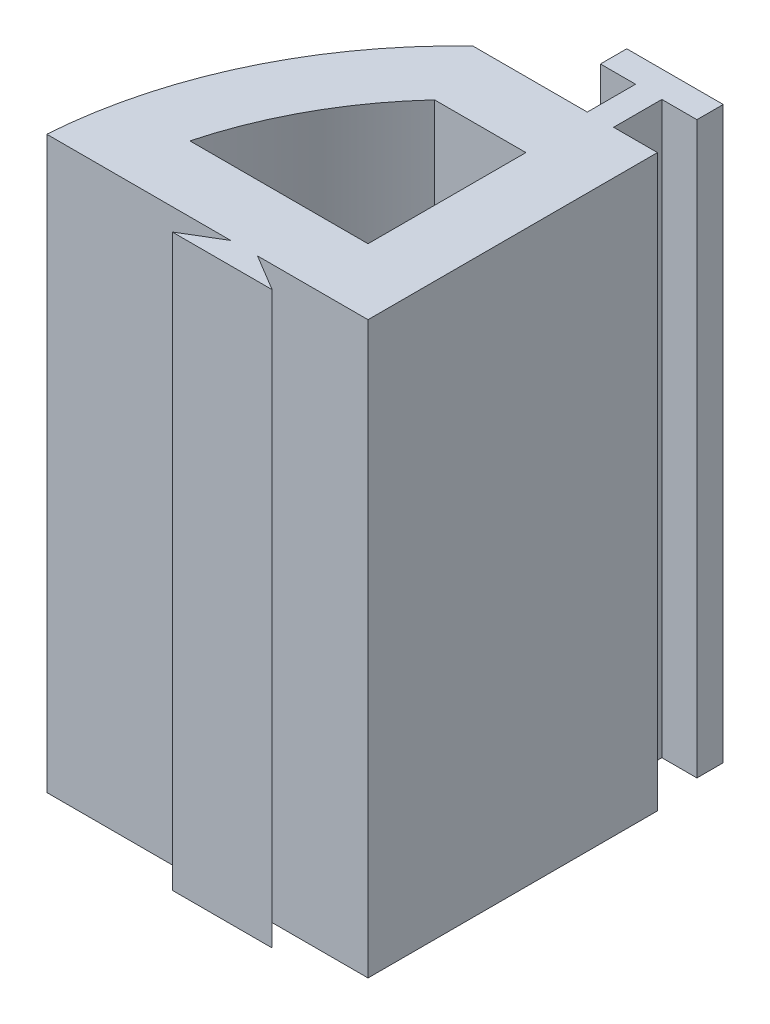
ISO-10303-21;
HEADER;
FILE_DESCRIPTION(('STEP AP214'),'2;1');
FILE_NAME('part.step','',(''),(''),'','','');
FILE_SCHEMA(('AUTOMOTIVE_DESIGN { 1 0 10303 214 1 1 1 1 }'));
ENDSEC;
DATA;
#1=APPLICATION_CONTEXT('core data for automotive mechanical design processes');
#2=APPLICATION_PROTOCOL_DEFINITION('international standard','automotive_design',2000,#1);
#3=PRODUCT_CONTEXT('',#1,'mechanical');
#4=PRODUCT('Part','Part','',(#3));
#5=PRODUCT_RELATED_PRODUCT_CATEGORY('part','',(#4));
#6=PRODUCT_DEFINITION_FORMATION('','',#4);
#7=PRODUCT_DEFINITION_CONTEXT('part definition',#1,'design');
#8=PRODUCT_DEFINITION('design','',#6,#7);
#9=PRODUCT_DEFINITION_SHAPE('','',#8);
#10=(LENGTH_UNIT() NAMED_UNIT(*) SI_UNIT(.MILLI.,.METRE.));
#11=(NAMED_UNIT(*) PLANE_ANGLE_UNIT() SI_UNIT($,.RADIAN.));
#12=(NAMED_UNIT(*) SI_UNIT($,.STERADIAN.) SOLID_ANGLE_UNIT());
#13=UNCERTAINTY_MEASURE_WITH_UNIT(LENGTH_MEASURE(1.E-05),#10,'distance_accuracy_value','');
#14=(GEOMETRIC_REPRESENTATION_CONTEXT(3) GLOBAL_UNCERTAINTY_ASSIGNED_CONTEXT((#13)) GLOBAL_UNIT_ASSIGNED_CONTEXT((#10,
#11,#12)) REPRESENTATION_CONTEXT('',''));
#15=CARTESIAN_POINT('',(0.,0.,0.));
#16=DIRECTION('',(0.,0.,1.));
#17=DIRECTION('',(1.,0.,0.));
#18=AXIS2_PLACEMENT_3D('',#15,#16,#17);
#19=CARTESIAN_POINT('',(0.,13.,-7.3));
#20=DIRECTION('',(0.,0.,-1.));
#21=DIRECTION('',(-1.,0.,0.));
#22=AXIS2_PLACEMENT_3D('',#19,#20,#21);
#23=PLANE('',#22);
#24=DIRECTION('',(1.,0.,0.));
#25=VECTOR('',#24,1.);
#26=CARTESIAN_POINT('',(0.,0.,-7.3));
#27=LINE('',#26,#25);
#28=CARTESIAN_POINT('',(-6.90742354282695,0.,-7.3));
#29=VERTEX_POINT('',#28);
#30=CARTESIAN_POINT('',(-4.3,0.,-7.3));
#31=VERTEX_POINT('',#30);
#32=EDGE_CURVE('E203',#29,#31,#27,.T.);
#33=ORIENTED_EDGE('',*,*,#32,.F.);
#34=DIRECTION('',(0.,-1.,0.));
#35=VECTOR('',#34,1.);
#36=CARTESIAN_POINT('',(-6.90742354282695,13.,-7.3));
#37=LINE('',#36,#35);
#38=CARTESIAN_POINT('',(-6.90742354282695,13.,-7.3));
#39=VERTEX_POINT('',#38);
#40=EDGE_CURVE('E11',#39,#29,#37,.T.);
#41=ORIENTED_EDGE('',*,*,#40,.F.);
#42=DIRECTION('',(1.,0.,0.));
#43=VECTOR('',#42,1.);
#44=CARTESIAN_POINT('',(0.,13.,-7.3));
#45=LINE('',#44,#43);
#46=CARTESIAN_POINT('',(-4.3,13.,-7.3));
#47=VERTEX_POINT('',#46);
#48=EDGE_CURVE('E207',#39,#47,#45,.T.);
#49=ORIENTED_EDGE('',*,*,#48,.T.);
#50=DIRECTION('',(0.,-1.,0.));
#51=VECTOR('',#50,1.);
#52=CARTESIAN_POINT('',(-4.3,13.,-7.3));
#53=LINE('',#52,#51);
#54=EDGE_CURVE('E249',#47,#31,#53,.T.);
#55=ORIENTED_EDGE('',*,*,#54,.T.);
#56=EDGE_LOOP('',(#33,#41,#49,#55));
#57=FACE_BOUND('',#56,.T.);
#58=ADVANCED_FACE('F34',(#57),#23,.T.);
#59=CARTESIAN_POINT('',(0.,13.,0.));
#60=DIRECTION('',(0.,-1.,0.));
#61=DIRECTION('',(0.,0.,-1.));
#62=AXIS2_PLACEMENT_3D('',#59,#60,#61);
#63=CYLINDRICAL_SURFACE('',#62,10.05);
#64=CARTESIAN_POINT('',(0.,0.,0.));
#65=DIRECTION('',(0.,1.,0.));
#66=DIRECTION('',(0.,0.,1.));
#67=AXIS2_PLACEMENT_3D('',#64,#65,#66);
#68=CIRCLE('',#67,10.05);
#69=CARTESIAN_POINT('',(-10.0255922518321,0.,-0.700000000002893));
#70=VERTEX_POINT('',#69);
#71=EDGE_CURVE('E252',#29,#70,#68,.T.);
#72=ORIENTED_EDGE('',*,*,#71,.T.);
#73=DIRECTION('',(0.,-1.,0.));
#74=VECTOR('',#73,1.);
#75=CARTESIAN_POINT('',(-10.0255922518321,13.,-0.700000000002893));
#76=LINE('',#75,#74);
#77=CARTESIAN_POINT('',(-10.0255922518321,13.,-0.700000000002893));
#78=VERTEX_POINT('',#77);
#79=EDGE_CURVE('E42',#78,#70,#76,.T.);
#80=ORIENTED_EDGE('',*,*,#79,.F.);
#81=CARTESIAN_POINT('',(0.,13.,0.));
#82=DIRECTION('',(0.,1.,0.));
#83=DIRECTION('',(0.,0.,1.));
#84=AXIS2_PLACEMENT_3D('',#81,#82,#83);
#85=CIRCLE('',#84,10.05);
#86=EDGE_CURVE('E210',#39,#78,#85,.T.);
#87=ORIENTED_EDGE('',*,*,#86,.F.);
#88=ORIENTED_EDGE('',*,*,#40,.T.);
#89=EDGE_LOOP('',(#72,#80,#87,#88));
#90=FACE_BOUND('',#89,.T.);
#91=ADVANCED_FACE('F36',(#90),#63,.T.);
#92=CARTESIAN_POINT('',(5.06438720404951E-13,13.,-0.69999999999564));
#93=DIRECTION('',(-7.23483886297294E-13,0.,1.));
#94=DIRECTION('',(1.,0.,7.23483886297294E-13));
#95=AXIS2_PLACEMENT_3D('',#92,#93,#94);
#96=PLANE('',#95);
#97=DIRECTION('',(-1.,0.,-7.23483886297294E-13));
#98=VECTOR('',#97,1.);
#99=CARTESIAN_POINT('',(5.06438720404951E-13,0.,-0.69999999999564));
#100=LINE('',#99,#98);
#101=CARTESIAN_POINT('',(-5.83063493683872,0.,-0.699999999999858));
#102=VERTEX_POINT('',#101);
#103=EDGE_CURVE('E256',#102,#70,#100,.T.);
#104=ORIENTED_EDGE('',*,*,#103,.F.);
#105=DIRECTION('',(0.,-1.,0.));
#106=VECTOR('',#105,1.);
#107=CARTESIAN_POINT('',(-5.83063493683872,13.,-0.699999999999858));
#108=LINE('',#107,#106);
#109=CARTESIAN_POINT('',(-5.83063493683872,13.,-0.699999999999858));
#110=VERTEX_POINT('',#109);
#111=EDGE_CURVE('E317',#110,#102,#108,.T.);
#112=ORIENTED_EDGE('',*,*,#111,.F.);
#113=DIRECTION('',(-1.,0.,-7.23483886297294E-13));
#114=VECTOR('',#113,1.);
#115=CARTESIAN_POINT('',(5.06438720404951E-13,13.,-0.69999999999564));
#116=LINE('',#115,#114);
#117=EDGE_CURVE('E214',#110,#78,#116,.T.);
#118=ORIENTED_EDGE('',*,*,#117,.T.);
#119=ORIENTED_EDGE('',*,*,#79,.T.);
#120=EDGE_LOOP('',(#104,#112,#118,#119));
#121=FACE_BOUND('',#120,.T.);
#122=ADVANCED_FACE('F321',(#121),#96,.T.);
#123=CARTESIAN_POINT('',(-1.85222689504543,13.,-3.08704482507578));
#124=DIRECTION('',(-0.514495755427519,0.,-0.857492925712549));
#125=DIRECTION('',(-0.857492925712549,0.,0.514495755427519));
#126=AXIS2_PLACEMENT_3D('',#123,#124,#125);
#127=PLANE('',#126);
#128=DIRECTION('',(0.857492925712549,0.,-0.514495755427519));
#129=VECTOR('',#128,1.);
#130=CARTESIAN_POINT('',(-1.85222689504543,0.,-3.08704482507578));
#131=LINE('',#130,#129);
#132=CARTESIAN_POINT('',(-6.66396827017183,0.,-0.199999999999999));
#133=VERTEX_POINT('',#132);
#134=EDGE_CURVE('E259',#133,#102,#131,.T.);
#135=ORIENTED_EDGE('',*,*,#134,.F.);
#136=DIRECTION('',(0.,-1.,0.));
#137=VECTOR('',#136,1.);
#138=CARTESIAN_POINT('',(-6.66396827017183,13.,-0.199999999999999));
#139=LINE('',#138,#137);
#140=CARTESIAN_POINT('',(-6.66396827017183,13.,-0.199999999999999));
#141=VERTEX_POINT('',#140);
#142=EDGE_CURVE('E315',#141,#133,#139,.T.);
#143=ORIENTED_EDGE('',*,*,#142,.F.);
#144=DIRECTION('',(0.857492925712549,0.,-0.514495755427519));
#145=VECTOR('',#144,1.);
#146=CARTESIAN_POINT('',(-1.85222689504543,13.,-3.08704482507578));
#147=LINE('',#146,#145);
#148=EDGE_CURVE('E217',#141,#110,#147,.T.);
#149=ORIENTED_EDGE('',*,*,#148,.T.);
#150=ORIENTED_EDGE('',*,*,#111,.T.);
#151=EDGE_LOOP('',(#135,#143,#149,#150));
#152=FACE_BOUND('',#151,.T.);
#153=ADVANCED_FACE('F331',(#152),#127,.T.);
#154=CARTESIAN_POINT('',(0.,13.,-0.2));
#155=DIRECTION('',(0.,0.,1.));
#156=DIRECTION('',(1.,0.,0.));
#157=AXIS2_PLACEMENT_3D('',#154,#155,#156);
#158=PLANE('',#157);
#159=DIRECTION('',(-1.,0.,0.));
#160=VECTOR('',#159,1.);
#161=CARTESIAN_POINT('',(0.,0.,-0.2));
#162=LINE('',#161,#160);
#163=CARTESIAN_POINT('',(-4.38603172982818,0.,-0.2));
#164=VERTEX_POINT('',#163);
#165=EDGE_CURVE('E263',#164,#133,#162,.T.);
#166=ORIENTED_EDGE('',*,*,#165,.F.);
#167=DIRECTION('',(0.,-1.,0.));
#168=VECTOR('',#167,1.);
#169=CARTESIAN_POINT('',(-4.38603172982818,13.,-0.2));
#170=LINE('',#169,#168);
#171=CARTESIAN_POINT('',(-4.38603172982818,13.,-0.2));
#172=VERTEX_POINT('',#171);
#173=EDGE_CURVE('E313',#172,#164,#170,.T.);
#174=ORIENTED_EDGE('',*,*,#173,.F.);
#175=DIRECTION('',(-1.,0.,0.));
#176=VECTOR('',#175,1.);
#177=CARTESIAN_POINT('',(0.,13.,-0.2));
#178=LINE('',#177,#176);
#179=EDGE_CURVE('E221',#172,#141,#178,.T.);
#180=ORIENTED_EDGE('',*,*,#179,.T.);
#181=ORIENTED_EDGE('',*,*,#142,.T.);
#182=EDGE_LOOP('',(#166,#174,#180,#181));
#183=FACE_BOUND('',#182,.T.);
#184=ADVANCED_FACE('F387',(#183),#158,.T.);
#185=CARTESIAN_POINT('',(-1.07277310495452,13.,1.7879551749242));
#186=DIRECTION('',(-0.514495755427527,0.,0.857492925712544));
#187=DIRECTION('',(0.857492925712544,0.,0.514495755427527));
#188=AXIS2_PLACEMENT_3D('',#185,#186,#187);
#189=PLANE('',#188);
#190=DIRECTION('',(-0.857492925712544,0.,-0.514495755427527));
#191=VECTOR('',#190,1.);
#192=CARTESIAN_POINT('',(-1.07277310495452,0.,1.7879551749242));
#193=LINE('',#192,#191);
#194=CARTESIAN_POINT('',(-5.21936506316047,0.,-0.699999999999416));
#195=VERTEX_POINT('',#194);
#196=EDGE_CURVE('E266',#164,#195,#193,.T.);
#197=ORIENTED_EDGE('',*,*,#196,.T.);
#198=DIRECTION('',(0.,-1.,0.));
#199=VECTOR('',#198,1.);
#200=CARTESIAN_POINT('',(-5.21936506316047,13.,-0.699999999999416));
#201=LINE('',#200,#199);
#202=CARTESIAN_POINT('',(-5.21936506316047,13.,-0.699999999999416));
#203=VERTEX_POINT('',#202);
#204=EDGE_CURVE('E311',#203,#195,#201,.T.);
#205=ORIENTED_EDGE('',*,*,#204,.F.);
#206=DIRECTION('',(-0.857492925712544,0.,-0.514495755427527));
#207=VECTOR('',#206,1.);
#208=CARTESIAN_POINT('',(-1.07277310495452,13.,1.7879551749242));
#209=LINE('',#208,#207);
#210=EDGE_CURVE('E224',#172,#203,#209,.T.);
#211=ORIENTED_EDGE('',*,*,#210,.F.);
#212=ORIENTED_EDGE('',*,*,#173,.T.);
#213=EDGE_LOOP('',(#197,#205,#211,#212));
#214=FACE_BOUND('',#213,.T.);
#215=ADVANCED_FACE('F385',(#214),#189,.F.);
#216=CARTESIAN_POINT('',(-2.70000000000038,0.,-0.699999999997593));
#217=VERTEX_POINT('',#216);
#218=EDGE_CURVE('E260',#217,#195,#100,.T.);
#219=ORIENTED_EDGE('',*,*,#218,.F.);
#220=DIRECTION('',(0.,-1.,0.));
#221=VECTOR('',#220,1.);
#222=CARTESIAN_POINT('',(-2.70000000000038,13.,-0.699999999997593));
#223=LINE('',#222,#221);
#224=CARTESIAN_POINT('',(-2.70000000000038,13.,-0.699999999997593));
#225=VERTEX_POINT('',#224);
#226=EDGE_CURVE('E309',#225,#217,#223,.T.);
#227=ORIENTED_EDGE('',*,*,#226,.F.);
#228=EDGE_CURVE('E218',#225,#203,#116,.T.);
#229=ORIENTED_EDGE('',*,*,#228,.T.);
#230=ORIENTED_EDGE('',*,*,#204,.T.);
#231=EDGE_LOOP('',(#219,#227,#229,#230));
#232=FACE_BOUND('',#231,.T.);
#233=ADVANCED_FACE('F379',(#232),#96,.T.);
#234=CARTESIAN_POINT('',(-2.70000000000038,13.,0.));
#235=DIRECTION('',(1.,0.,0.));
#236=DIRECTION('',(0.,0.,-1.));
#237=AXIS2_PLACEMENT_3D('',#234,#235,#236);
#238=PLANE('',#237);
#239=DIRECTION('',(0.,0.,1.));
#240=VECTOR('',#239,1.);
#241=CARTESIAN_POINT('',(-2.70000000000038,0.,0.));
#242=LINE('',#241,#240);
#243=CARTESIAN_POINT('',(-2.70000000000038,0.,-7.3));
#244=VERTEX_POINT('',#243);
#245=EDGE_CURVE('E269',#244,#217,#242,.T.);
#246=ORIENTED_EDGE('',*,*,#245,.F.);
#247=DIRECTION('',(0.,-1.,0.));
#248=VECTOR('',#247,1.);
#249=CARTESIAN_POINT('',(-2.70000000000038,13.,-7.3));
#250=LINE('',#249,#248);
#251=CARTESIAN_POINT('',(-2.70000000000038,13.,-7.3));
#252=VERTEX_POINT('',#251);
#253=EDGE_CURVE('E307',#252,#244,#250,.T.);
#254=ORIENTED_EDGE('',*,*,#253,.F.);
#255=DIRECTION('',(0.,0.,1.));
#256=VECTOR('',#255,1.);
#257=CARTESIAN_POINT('',(-2.70000000000038,13.,0.));
#258=LINE('',#257,#256);
#259=EDGE_CURVE('E226',#252,#225,#258,.T.);
#260=ORIENTED_EDGE('',*,*,#259,.T.);
#261=ORIENTED_EDGE('',*,*,#226,.T.);
#262=EDGE_LOOP('',(#246,#254,#260,#261));
#263=FACE_BOUND('',#262,.T.);
#264=ADVANCED_FACE('F375',(#263),#238,.T.);
#265=CARTESIAN_POINT('',(-3.70000000000029,0.,-7.3));
#266=VERTEX_POINT('',#265);
#267=EDGE_CURVE('E253',#266,#244,#27,.T.);
#268=ORIENTED_EDGE('',*,*,#267,.F.);
#269=DIRECTION('',(0.,-1.,0.));
#270=VECTOR('',#269,1.);
#271=CARTESIAN_POINT('',(-3.70000000000029,13.,-7.3));
#272=LINE('',#271,#270);
#273=CARTESIAN_POINT('',(-3.70000000000029,13.,-7.3));
#274=VERTEX_POINT('',#273);
#275=EDGE_CURVE('E305',#274,#266,#272,.T.);
#276=ORIENTED_EDGE('',*,*,#275,.F.);
#277=EDGE_CURVE('E212',#274,#252,#45,.T.);
#278=ORIENTED_EDGE('',*,*,#277,.T.);
#279=ORIENTED_EDGE('',*,*,#253,.T.);
#280=EDGE_LOOP('',(#268,#276,#278,#279));
#281=FACE_BOUND('',#280,.T.);
#282=ADVANCED_FACE('F371',(#281),#23,.T.);
#283=CARTESIAN_POINT('',(-3.70000000000029,13.,0.));
#284=DIRECTION('',(1.,0.,0.));
#285=DIRECTION('',(0.,0.,-1.));
#286=AXIS2_PLACEMENT_3D('',#283,#284,#285);
#287=PLANE('',#286);
#288=DIRECTION('',(0.,0.,1.));
#289=VECTOR('',#288,1.);
#290=CARTESIAN_POINT('',(-3.70000000000029,0.,0.));
#291=LINE('',#290,#289);
#292=CARTESIAN_POINT('',(-3.70000000000029,0.,-8.4));
#293=VERTEX_POINT('',#292);
#294=EDGE_CURVE('E272',#293,#266,#291,.T.);
#295=ORIENTED_EDGE('',*,*,#294,.F.);
#296=DIRECTION('',(0.,-1.,0.));
#297=VECTOR('',#296,1.);
#298=CARTESIAN_POINT('',(-3.70000000000029,13.,-8.4));
#299=LINE('',#298,#297);
#300=CARTESIAN_POINT('',(-3.70000000000029,13.,-8.4));
#301=VERTEX_POINT('',#300);
#302=EDGE_CURVE('E303',#301,#293,#299,.T.);
#303=ORIENTED_EDGE('',*,*,#302,.F.);
#304=DIRECTION('',(0.,0.,1.));
#305=VECTOR('',#304,1.);
#306=CARTESIAN_POINT('',(-3.70000000000029,13.,0.));
#307=LINE('',#306,#305);
#308=EDGE_CURVE('E229',#301,#274,#307,.T.);
#309=ORIENTED_EDGE('',*,*,#308,.T.);
#310=ORIENTED_EDGE('',*,*,#275,.T.);
#311=EDGE_LOOP('',(#295,#303,#309,#310));
#312=FACE_BOUND('',#311,.T.);
#313=ADVANCED_FACE('F366',(#312),#287,.T.);
#314=CARTESIAN_POINT('',(0.,13.,-8.4));
#315=DIRECTION('',(0.,0.,1.));
#316=DIRECTION('',(1.,0.,0.));
#317=AXIS2_PLACEMENT_3D('',#314,#315,#316);
#318=PLANE('',#317);
#319=DIRECTION('',(-1.,0.,0.));
#320=VECTOR('',#319,1.);
#321=CARTESIAN_POINT('',(0.,0.,-8.4));
#322=LINE('',#321,#320);
#323=CARTESIAN_POINT('',(-2.90000000000029,0.,-8.4));
#324=VERTEX_POINT('',#323);
#325=EDGE_CURVE('E275',#324,#293,#322,.T.);
#326=ORIENTED_EDGE('',*,*,#325,.F.);
#327=DIRECTION('',(0.,-1.,0.));
#328=VECTOR('',#327,1.);
#329=CARTESIAN_POINT('',(-2.90000000000029,13.,-8.4));
#330=LINE('',#329,#328);
#331=CARTESIAN_POINT('',(-2.90000000000029,13.,-8.4));
#332=VERTEX_POINT('',#331);
#333=EDGE_CURVE('E301',#332,#324,#330,.T.);
#334=ORIENTED_EDGE('',*,*,#333,.F.);
#335=DIRECTION('',(-1.,0.,0.));
#336=VECTOR('',#335,1.);
#337=CARTESIAN_POINT('',(0.,13.,-8.4));
#338=LINE('',#337,#336);
#339=EDGE_CURVE('E232',#332,#301,#338,.T.);
#340=ORIENTED_EDGE('',*,*,#339,.T.);
#341=ORIENTED_EDGE('',*,*,#302,.T.);
#342=EDGE_LOOP('',(#326,#334,#340,#341));
#343=FACE_BOUND('',#342,.T.);
#344=ADVANCED_FACE('F361',(#343),#318,.T.);
#345=CARTESIAN_POINT('',(-2.90000000000029,13.,0.));
#346=DIRECTION('',(1.,0.,0.));
#347=DIRECTION('',(0.,0.,-1.));
#348=AXIS2_PLACEMENT_3D('',#345,#346,#347);
#349=PLANE('',#348);
#350=DIRECTION('',(0.,0.,1.));
#351=VECTOR('',#350,1.);
#352=CARTESIAN_POINT('',(-2.90000000000029,0.,0.));
#353=LINE('',#352,#351);
#354=CARTESIAN_POINT('',(-2.90000000000029,0.,-9.));
#355=VERTEX_POINT('',#354);
#356=EDGE_CURVE('E278',#355,#324,#353,.T.);
#357=ORIENTED_EDGE('',*,*,#356,.F.);
#358=DIRECTION('',(0.,-1.,0.));
#359=VECTOR('',#358,1.);
#360=CARTESIAN_POINT('',(-2.90000000000029,13.,-9.));
#361=LINE('',#360,#359);
#362=CARTESIAN_POINT('',(-2.90000000000029,13.,-9.));
#363=VERTEX_POINT('',#362);
#364=EDGE_CURVE('E299',#363,#355,#361,.T.);
#365=ORIENTED_EDGE('',*,*,#364,.F.);
#366=DIRECTION('',(0.,0.,1.));
#367=VECTOR('',#366,1.);
#368=CARTESIAN_POINT('',(-2.90000000000029,13.,0.));
#369=LINE('',#368,#367);
#370=EDGE_CURVE('E235',#363,#332,#369,.T.);
#371=ORIENTED_EDGE('',*,*,#370,.T.);
#372=ORIENTED_EDGE('',*,*,#333,.T.);
#373=EDGE_LOOP('',(#357,#365,#371,#372));
#374=FACE_BOUND('',#373,.T.);
#375=ADVANCED_FACE('F357',(#374),#349,.T.);
#376=CARTESIAN_POINT('',(0.,13.,-9.));
#377=DIRECTION('',(0.,0.,-1.));
#378=DIRECTION('',(-1.,0.,0.));
#379=AXIS2_PLACEMENT_3D('',#376,#377,#378);
#380=PLANE('',#379);
#381=DIRECTION('',(1.,0.,0.));
#382=VECTOR('',#381,1.);
#383=CARTESIAN_POINT('',(0.,0.,-9.));
#384=LINE('',#383,#382);
#385=CARTESIAN_POINT('',(-5.1,0.,-9.));
#386=VERTEX_POINT('',#385);
#387=EDGE_CURVE('E281',#386,#355,#384,.T.);
#388=ORIENTED_EDGE('',*,*,#387,.F.);
#389=DIRECTION('',(0.,-1.,0.));
#390=VECTOR('',#389,1.);
#391=CARTESIAN_POINT('',(-5.1,13.,-9.));
#392=LINE('',#391,#390);
#393=CARTESIAN_POINT('',(-5.1,13.,-9.));
#394=VERTEX_POINT('',#393);
#395=EDGE_CURVE('E297',#394,#386,#392,.T.);
#396=ORIENTED_EDGE('',*,*,#395,.F.);
#397=DIRECTION('',(1.,0.,0.));
#398=VECTOR('',#397,1.);
#399=CARTESIAN_POINT('',(0.,13.,-9.));
#400=LINE('',#399,#398);
#401=EDGE_CURVE('E238',#394,#363,#400,.T.);
#402=ORIENTED_EDGE('',*,*,#401,.T.);
#403=ORIENTED_EDGE('',*,*,#364,.T.);
#404=EDGE_LOOP('',(#388,#396,#402,#403));
#405=FACE_BOUND('',#404,.T.);
#406=ADVANCED_FACE('F353',(#405),#380,.T.);
#407=CARTESIAN_POINT('',(-5.1,13.,0.));
#408=DIRECTION('',(-1.,0.,0.));
#409=DIRECTION('',(0.,0.,1.));
#410=AXIS2_PLACEMENT_3D('',#407,#408,#409);
#411=PLANE('',#410);
#412=DIRECTION('',(0.,0.,-1.));
#413=VECTOR('',#412,1.);
#414=CARTESIAN_POINT('',(-5.1,0.,0.));
#415=LINE('',#414,#413);
#416=CARTESIAN_POINT('',(-5.1,0.,-8.4));
#417=VERTEX_POINT('',#416);
#418=EDGE_CURVE('E284',#417,#386,#415,.T.);
#419=ORIENTED_EDGE('',*,*,#418,.F.);
#420=DIRECTION('',(0.,-1.,0.));
#421=VECTOR('',#420,1.);
#422=CARTESIAN_POINT('',(-5.1,13.,-8.4));
#423=LINE('',#422,#421);
#424=CARTESIAN_POINT('',(-5.1,13.,-8.4));
#425=VERTEX_POINT('',#424);
#426=EDGE_CURVE('E295',#425,#417,#423,.T.);
#427=ORIENTED_EDGE('',*,*,#426,.F.);
#428=DIRECTION('',(0.,0.,-1.));
#429=VECTOR('',#428,1.);
#430=CARTESIAN_POINT('',(-5.1,13.,0.));
#431=LINE('',#430,#429);
#432=EDGE_CURVE('E241',#425,#394,#431,.T.);
#433=ORIENTED_EDGE('',*,*,#432,.T.);
#434=ORIENTED_EDGE('',*,*,#395,.T.);
#435=EDGE_LOOP('',(#419,#427,#433,#434));
#436=FACE_BOUND('',#435,.T.);
#437=ADVANCED_FACE('F349',(#436),#411,.T.);
#438=CARTESIAN_POINT('',(0.,13.,-8.4));
#439=DIRECTION('',(0.,0.,1.));
#440=DIRECTION('',(1.,0.,0.));
#441=AXIS2_PLACEMENT_3D('',#438,#439,#440);
#442=PLANE('',#441);
#443=DIRECTION('',(-1.,0.,0.));
#444=VECTOR('',#443,1.);
#445=CARTESIAN_POINT('',(0.,0.,-8.4));
#446=LINE('',#445,#444);
#447=CARTESIAN_POINT('',(-4.3,0.,-8.4));
#448=VERTEX_POINT('',#447);
#449=EDGE_CURVE('E287',#448,#417,#446,.T.);
#450=ORIENTED_EDGE('',*,*,#449,.F.);
#451=DIRECTION('',(0.,-1.,0.));
#452=VECTOR('',#451,1.);
#453=CARTESIAN_POINT('',(-4.3,13.,-8.4));
#454=LINE('',#453,#452);
#455=CARTESIAN_POINT('',(-4.3,13.,-8.4));
#456=VERTEX_POINT('',#455);
#457=EDGE_CURVE('E293',#456,#448,#454,.T.);
#458=ORIENTED_EDGE('',*,*,#457,.F.);
#459=DIRECTION('',(-1.,0.,0.));
#460=VECTOR('',#459,1.);
#461=CARTESIAN_POINT('',(0.,13.,-8.4));
#462=LINE('',#461,#460);
#463=EDGE_CURVE('E244',#456,#425,#462,.T.);
#464=ORIENTED_EDGE('',*,*,#463,.T.);
#465=ORIENTED_EDGE('',*,*,#426,.T.);
#466=EDGE_LOOP('',(#450,#458,#464,#465));
#467=FACE_BOUND('',#466,.T.);
#468=ADVANCED_FACE('F345',(#467),#442,.T.);
#469=CARTESIAN_POINT('',(-4.3,13.,0.));
#470=DIRECTION('',(1.,0.,0.));
#471=DIRECTION('',(0.,0.,-1.));
#472=AXIS2_PLACEMENT_3D('',#469,#470,#471);
#473=PLANE('',#472);
#474=DIRECTION('',(0.,0.,1.));
#475=VECTOR('',#474,1.);
#476=CARTESIAN_POINT('',(-4.3,0.,0.));
#477=LINE('',#476,#475);
#478=EDGE_CURVE('E211',#448,#31,#477,.T.);
#479=ORIENTED_EDGE('',*,*,#478,.T.);
#480=ORIENTED_EDGE('',*,*,#54,.F.);
#481=DIRECTION('',(0.,0.,1.));
#482=VECTOR('',#481,1.);
#483=CARTESIAN_POINT('',(-4.3,13.,0.));
#484=LINE('',#483,#482);
#485=EDGE_CURVE('E247',#456,#47,#484,.T.);
#486=ORIENTED_EDGE('',*,*,#485,.F.);
#487=ORIENTED_EDGE('',*,*,#457,.T.);
#488=EDGE_LOOP('',(#479,#480,#486,#487));
#489=FACE_BOUND('',#488,.T.);
#490=ADVANCED_FACE('F495',(#489),#473,.F.);
#491=CARTESIAN_POINT('',(0.,13.,0.));
#492=DIRECTION('',(0.,1.,0.));
#493=DIRECTION('',(0.,0.,1.));
#494=AXIS2_PLACEMENT_3D('',#491,#492,#493);
#495=PLANE('',#494);
#496=DIRECTION('',(-1.,0.,0.));
#497=VECTOR('',#496,1.);
#498=CARTESIAN_POINT('',(0.,13.,-5.8));
#499=LINE('',#498,#497);
#500=CARTESIAN_POINT('',(-4.20000000000038,13.,-5.8));
#501=VERTEX_POINT('',#500);
#502=CARTESIAN_POINT('',(-6.28191849676514,13.,-5.8));
#503=VERTEX_POINT('',#502);
#504=EDGE_CURVE('E49',#501,#503,#499,.T.);
#505=ORIENTED_EDGE('',*,*,#504,.F.);
#506=DIRECTION('',(0.,0.,-1.));
#507=VECTOR('',#506,1.);
#508=CARTESIAN_POINT('',(-4.20000000000038,13.,0.));
#509=LINE('',#508,#507);
#510=CARTESIAN_POINT('',(-4.20000000000038,13.,-2.20000000000282));
#511=VERTEX_POINT('',#510);
#512=EDGE_CURVE('E188',#511,#501,#509,.T.);
#513=ORIENTED_EDGE('',*,*,#512,.F.);
#514=DIRECTION('',(1.,0.,0.));
#515=VECTOR('',#514,1.);
#516=CARTESIAN_POINT('',(0.,13.,-2.20000000000282));
#517=LINE('',#516,#515);
#518=CARTESIAN_POINT('',(-8.26211232070756,13.,-2.20000000000282));
#519=VERTEX_POINT('',#518);
#520=EDGE_CURVE('E191',#519,#511,#517,.T.);
#521=ORIENTED_EDGE('',*,*,#520,.F.);
#522=CARTESIAN_POINT('',(0.,13.,0.));
#523=DIRECTION('',(0.,1.,0.));
#524=DIRECTION('',(0.,0.,1.));
#525=AXIS2_PLACEMENT_3D('',#522,#523,#524);
#526=CIRCLE('',#525,8.55);
#527=EDGE_CURVE('E197',#503,#519,#526,.T.);
#528=ORIENTED_EDGE('',*,*,#527,.F.);
#529=EDGE_LOOP('',(#505,#513,#521,#528));
#530=FACE_BOUND('',#529,.T.);
#531=ORIENTED_EDGE('',*,*,#48,.F.);
#532=ORIENTED_EDGE('',*,*,#86,.T.);
#533=ORIENTED_EDGE('',*,*,#117,.F.);
#534=ORIENTED_EDGE('',*,*,#148,.F.);
#535=ORIENTED_EDGE('',*,*,#179,.F.);
#536=ORIENTED_EDGE('',*,*,#210,.T.);
#537=ORIENTED_EDGE('',*,*,#228,.F.);
#538=ORIENTED_EDGE('',*,*,#259,.F.);
#539=ORIENTED_EDGE('',*,*,#277,.F.);
#540=ORIENTED_EDGE('',*,*,#308,.F.);
#541=ORIENTED_EDGE('',*,*,#339,.F.);
#542=ORIENTED_EDGE('',*,*,#370,.F.);
#543=ORIENTED_EDGE('',*,*,#401,.F.);
#544=ORIENTED_EDGE('',*,*,#432,.F.);
#545=ORIENTED_EDGE('',*,*,#463,.F.);
#546=ORIENTED_EDGE('',*,*,#485,.T.);
#547=EDGE_LOOP('',(#531,#532,#533,#534,#535,#536,#537,#538,#539,#540,#541,#542,#543,#544,#545,#546));
#548=FACE_BOUND('',#547,.T.);
#549=ADVANCED_FACE('F335',(#530,#548),#495,.T.);
#550=CARTESIAN_POINT('',(0.,0.,0.));
#551=DIRECTION('',(0.,1.,0.));
#552=DIRECTION('',(0.,0.,1.));
#553=AXIS2_PLACEMENT_3D('',#550,#551,#552);
#554=PLANE('',#553);
#555=DIRECTION('',(0.,0.,-1.));
#556=VECTOR('',#555,1.);
#557=CARTESIAN_POINT('',(-4.20000000000038,0.,0.));
#558=LINE('',#557,#556);
#559=CARTESIAN_POINT('',(-4.20000000000038,0.,-2.20000000000282));
#560=VERTEX_POINT('',#559);
#561=CARTESIAN_POINT('',(-4.20000000000038,0.,-5.8));
#562=VERTEX_POINT('',#561);
#563=EDGE_CURVE('E178',#560,#562,#558,.T.);
#564=ORIENTED_EDGE('',*,*,#563,.T.);
#565=DIRECTION('',(-1.,0.,0.));
#566=VECTOR('',#565,1.);
#567=CARTESIAN_POINT('',(0.,0.,-5.8));
#568=LINE('',#567,#566);
#569=CARTESIAN_POINT('',(-6.28191849676514,0.,-5.8));
#570=VERTEX_POINT('',#569);
#571=EDGE_CURVE('E172',#562,#570,#568,.T.);
#572=ORIENTED_EDGE('',*,*,#571,.T.);
#573=CARTESIAN_POINT('',(0.,0.,0.));
#574=DIRECTION('',(0.,1.,0.));
#575=DIRECTION('',(0.,0.,1.));
#576=AXIS2_PLACEMENT_3D('',#573,#574,#575);
#577=CIRCLE('',#576,8.55);
#578=CARTESIAN_POINT('',(-8.26211232070756,0.,-2.20000000000282));
#579=VERTEX_POINT('',#578);
#580=EDGE_CURVE('E181',#570,#579,#577,.T.);
#581=ORIENTED_EDGE('',*,*,#580,.T.);
#582=DIRECTION('',(1.,0.,0.));
#583=VECTOR('',#582,1.);
#584=CARTESIAN_POINT('',(0.,0.,-2.20000000000282));
#585=LINE('',#584,#583);
#586=EDGE_CURVE('E57',#579,#560,#585,.T.);
#587=ORIENTED_EDGE('',*,*,#586,.T.);
#588=EDGE_LOOP('',(#564,#572,#581,#587));
#589=FACE_BOUND('',#588,.T.);
#590=ORIENTED_EDGE('',*,*,#32,.T.);
#591=ORIENTED_EDGE('',*,*,#478,.F.);
#592=ORIENTED_EDGE('',*,*,#449,.T.);
#593=ORIENTED_EDGE('',*,*,#418,.T.);
#594=ORIENTED_EDGE('',*,*,#387,.T.);
#595=ORIENTED_EDGE('',*,*,#356,.T.);
#596=ORIENTED_EDGE('',*,*,#325,.T.);
#597=ORIENTED_EDGE('',*,*,#294,.T.);
#598=ORIENTED_EDGE('',*,*,#267,.T.);
#599=ORIENTED_EDGE('',*,*,#245,.T.);
#600=ORIENTED_EDGE('',*,*,#218,.T.);
#601=ORIENTED_EDGE('',*,*,#196,.F.);
#602=ORIENTED_EDGE('',*,*,#165,.T.);
#603=ORIENTED_EDGE('',*,*,#134,.T.);
#604=ORIENTED_EDGE('',*,*,#103,.T.);
#605=ORIENTED_EDGE('',*,*,#71,.F.);
#606=EDGE_LOOP('',(#590,#591,#592,#593,#594,#595,#596,#597,#598,#599,#600,#601,#602,#603,#604,#605));
#607=FACE_BOUND('',#606,.T.);
#608=ADVANCED_FACE('F185',(#589,#607),#554,.F.);
#609=CARTESIAN_POINT('',(0.,0.,-5.8));
#610=DIRECTION('',(0.,0.,-1.));
#611=DIRECTION('',(-1.,0.,0.));
#612=AXIS2_PLACEMENT_3D('',#609,#610,#611);
#613=PLANE('',#612);
#614=ORIENTED_EDGE('',*,*,#504,.T.);
#615=DIRECTION('',(0.,1.,0.));
#616=VECTOR('',#615,1.);
#617=CARTESIAN_POINT('',(-6.28191849676514,0.,-5.8));
#618=LINE('',#617,#616);
#619=EDGE_CURVE('E168',#570,#503,#618,.T.);
#620=ORIENTED_EDGE('',*,*,#619,.F.);
#621=ORIENTED_EDGE('',*,*,#571,.F.);
#622=DIRECTION('',(0.,1.,0.));
#623=VECTOR('',#622,1.);
#624=CARTESIAN_POINT('',(-4.20000000000038,0.,-5.8));
#625=LINE('',#624,#623);
#626=EDGE_CURVE('E201',#562,#501,#625,.T.);
#627=ORIENTED_EDGE('',*,*,#626,.T.);
#628=EDGE_LOOP('',(#614,#620,#621,#627));
#629=FACE_BOUND('',#628,.T.);
#630=ADVANCED_FACE('F170',(#629),#613,.F.);
#631=CARTESIAN_POINT('',(-4.20000000000038,0.,0.));
#632=DIRECTION('',(1.,0.,0.));
#633=DIRECTION('',(0.,0.,-1.));
#634=AXIS2_PLACEMENT_3D('',#631,#632,#633);
#635=PLANE('',#634);
#636=ORIENTED_EDGE('',*,*,#512,.T.);
#637=ORIENTED_EDGE('',*,*,#626,.F.);
#638=ORIENTED_EDGE('',*,*,#563,.F.);
#639=DIRECTION('',(0.,1.,0.));
#640=VECTOR('',#639,1.);
#641=CARTESIAN_POINT('',(-4.20000000000038,0.,-2.20000000000282));
#642=LINE('',#641,#640);
#643=EDGE_CURVE('E204',#560,#511,#642,.T.);
#644=ORIENTED_EDGE('',*,*,#643,.T.);
#645=EDGE_LOOP('',(#636,#637,#638,#644));
#646=FACE_BOUND('',#645,.T.);
#647=ADVANCED_FACE('F534',(#646),#635,.F.);
#648=CARTESIAN_POINT('',(0.,0.,-2.20000000000282));
#649=DIRECTION('',(0.,0.,1.));
#650=DIRECTION('',(1.,0.,0.));
#651=AXIS2_PLACEMENT_3D('',#648,#649,#650);
#652=PLANE('',#651);
#653=ORIENTED_EDGE('',*,*,#520,.T.);
#654=ORIENTED_EDGE('',*,*,#643,.F.);
#655=ORIENTED_EDGE('',*,*,#586,.F.);
#656=DIRECTION('',(0.,1.,0.));
#657=VECTOR('',#656,1.);
#658=CARTESIAN_POINT('',(-8.26211232070756,0.,-2.20000000000282));
#659=LINE('',#658,#657);
#660=EDGE_CURVE('E177',#579,#519,#659,.T.);
#661=ORIENTED_EDGE('',*,*,#660,.T.);
#662=EDGE_LOOP('',(#653,#654,#655,#661));
#663=FACE_BOUND('',#662,.T.);
#664=ADVANCED_FACE('F543',(#663),#652,.F.);
#665=CARTESIAN_POINT('',(0.,0.,0.));
#666=DIRECTION('',(0.,1.,0.));
#667=DIRECTION('',(0.,0.,1.));
#668=AXIS2_PLACEMENT_3D('',#665,#666,#667);
#669=CYLINDRICAL_SURFACE('',#668,8.55);
#670=ORIENTED_EDGE('',*,*,#527,.T.);
#671=ORIENTED_EDGE('',*,*,#660,.F.);
#672=ORIENTED_EDGE('',*,*,#580,.F.);
#673=ORIENTED_EDGE('',*,*,#619,.T.);
#674=EDGE_LOOP('',(#670,#671,#672,#673));
#675=FACE_BOUND('',#674,.T.);
#676=ADVANCED_FACE('F182',(#675),#669,.F.);
#677=CLOSED_SHELL('',(#58,#91,#122,#153,#184,#215,#233,#264,#282,#313,#344,#375,#406,#437,#468,
#490,#549,#608,#630,#647,#664,#676));
#678=MANIFOLD_SOLID_BREP('B2',#677);
#679=ADVANCED_BREP_SHAPE_REPRESENTATION('',(#18,#678),#14);
#680=SHAPE_DEFINITION_REPRESENTATION(#9,#679);
ENDSEC;
END-ISO-10303-21;
